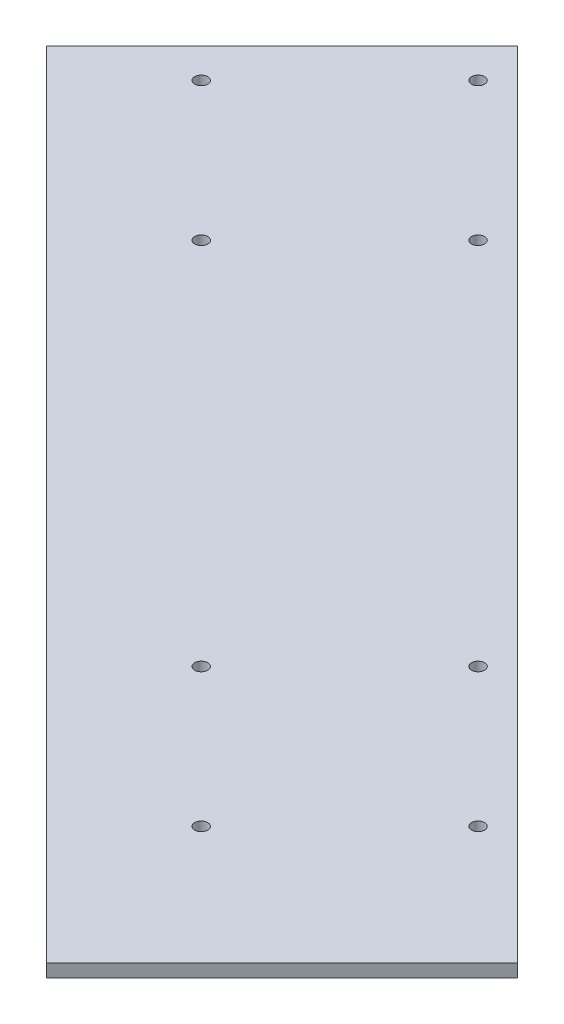
ISO-10303-21;
HEADER;
FILE_DESCRIPTION(('STEP AP214'),'2;1');
FILE_NAME('part.step','',(''),(''),'','','');
FILE_SCHEMA(('AUTOMOTIVE_DESIGN { 1 0 10303 214 1 1 1 1 }'));
ENDSEC;
DATA;
#1=APPLICATION_CONTEXT('core data for automotive mechanical design processes');
#2=APPLICATION_PROTOCOL_DEFINITION('international standard','automotive_design',2000,#1);
#3=PRODUCT_CONTEXT('',#1,'mechanical');
#4=PRODUCT('Part','Part','',(#3));
#5=PRODUCT_RELATED_PRODUCT_CATEGORY('part','',(#4));
#6=PRODUCT_DEFINITION_FORMATION('','',#4);
#7=PRODUCT_DEFINITION_CONTEXT('part definition',#1,'design');
#8=PRODUCT_DEFINITION('design','',#6,#7);
#9=PRODUCT_DEFINITION_SHAPE('','',#8);
#10=(LENGTH_UNIT() NAMED_UNIT(*) SI_UNIT(.MILLI.,.METRE.));
#11=(NAMED_UNIT(*) PLANE_ANGLE_UNIT() SI_UNIT($,.RADIAN.));
#12=(NAMED_UNIT(*) SI_UNIT($,.STERADIAN.) SOLID_ANGLE_UNIT());
#13=UNCERTAINTY_MEASURE_WITH_UNIT(LENGTH_MEASURE(1.E-05),#10,'distance_accuracy_value','');
#14=(GEOMETRIC_REPRESENTATION_CONTEXT(3) GLOBAL_UNCERTAINTY_ASSIGNED_CONTEXT((#13)) GLOBAL_UNIT_ASSIGNED_CONTEXT((#10,
#11,#12)) REPRESENTATION_CONTEXT('',''));
#15=CARTESIAN_POINT('',(0.,0.,0.));
#16=DIRECTION('',(0.,0.,1.));
#17=DIRECTION('',(1.,0.,0.));
#18=AXIS2_PLACEMENT_3D('',#15,#16,#17);
#19=CARTESIAN_POINT('',(0.,10.,0.));
#20=DIRECTION('',(0.,1.,0.));
#21=DIRECTION('',(0.,0.,1.));
#22=AXIS2_PLACEMENT_3D('',#19,#20,#21);
#23=PLANE('',#22);
#24=DIRECTION('',(0.707106781186548,0.,0.707106781186548));
#25=VECTOR('',#24,1.);
#26=CARTESIAN_POINT('',(-469.383041957652,10.,-289.075244035555));
#27=LINE('',#26,#25);
#28=CARTESIAN_POINT('',(-469.383041957652,10.,-289.075244035555));
#29=VERTEX_POINT('',#28);
#30=CARTESIAN_POINT('',(139.075244035559,10.,319.383041957656));
#31=VERTEX_POINT('',#30);
#32=EDGE_CURVE('E79',#29,#31,#27,.T.);
#33=ORIENTED_EDGE('',*,*,#32,.F.);
#34=DIRECTION('',(0.707106781186549,0.,-0.707106781186547));
#35=VECTOR('',#34,1.);
#36=CARTESIAN_POINT('',(-650.,10.,-108.458285993207));
#37=LINE('',#36,#35);
#38=CARTESIAN_POINT('',(-650.,10.,-108.458285993207));
#39=VERTEX_POINT('',#38);
#40=EDGE_CURVE('E105',#39,#29,#37,.T.);
#41=ORIENTED_EDGE('',*,*,#40,.F.);
#42=DIRECTION('',(-0.707106781186551,0.,-0.707106781186544));
#43=VECTOR('',#42,1.);
#44=CARTESIAN_POINT('',(-41.5417140067861,10.,500.));
#45=LINE('',#44,#43);
#46=CARTESIAN_POINT('',(-41.5417140067861,10.,500.));
#47=VERTEX_POINT('',#46);
#48=EDGE_CURVE('E99',#47,#39,#45,.T.);
#49=ORIENTED_EDGE('',*,*,#48,.F.);
#50=DIRECTION('',(-0.707106781186548,0.,0.707106781186547));
#51=VECTOR('',#50,1.);
#52=CARTESIAN_POINT('',(-41.5417140067861,10.,500.));
#53=LINE('',#52,#51);
#54=EDGE_CURVE('E94',#31,#47,#53,.T.);
#55=ORIENTED_EDGE('',*,*,#54,.F.);
#56=EDGE_LOOP('',(#33,#41,#49,#55));
#57=FACE_BOUND('',#56,.T.);
#58=CARTESIAN_POINT('',(33.2340187157668,10.,243.933982822018));
#59=DIRECTION('',(0.,1.,0.));
#60=DIRECTION('',(0.,0.,1.));
#61=AXIS2_PLACEMENT_3D('',#58,#59,#60);
#62=CIRCLE('',#61,5.);
#63=CARTESIAN_POINT('',(33.2340187157668,10.,248.933982822018));
#64=VERTEX_POINT('',#63);
#65=EDGE_CURVE('E130',#64,#64,#62,.T.);
#66=ORIENTED_EDGE('',*,*,#65,.F.);
#67=EDGE_LOOP('',(#66));
#68=FACE_BOUND('',#67,.T.);
#69=CARTESIAN_POINT('',(-72.8319984622154,10.,350.));
#70=DIRECTION('',(0.,1.,0.));
#71=DIRECTION('',(0.,0.,1.));
#72=AXIS2_PLACEMENT_3D('',#69,#70,#71);
#73=CIRCLE('',#72,4.99999999999999);
#74=CARTESIAN_POINT('',(-72.8319984622154,10.,355.));
#75=VERTEX_POINT('',#74);
#76=EDGE_CURVE('E136',#75,#75,#73,.T.);
#77=ORIENTED_EDGE('',*,*,#76,.F.);
#78=EDGE_LOOP('',(#77));
#79=FACE_BOUND('',#78,.T.);
#80=CARTESIAN_POINT('',(-178.898015640198,10.,243.933982822018));
#81=DIRECTION('',(0.,1.,0.));
#82=DIRECTION('',(0.,0.,1.));
#83=AXIS2_PLACEMENT_3D('',#80,#81,#82);
#84=CIRCLE('',#83,5.00000000000011);
#85=CARTESIAN_POINT('',(-178.898015640198,10.,248.933982822018));
#86=VERTEX_POINT('',#85);
#87=EDGE_CURVE('E142',#86,#86,#84,.T.);
#88=ORIENTED_EDGE('',*,*,#87,.F.);
#89=EDGE_LOOP('',(#88));
#90=FACE_BOUND('',#89,.T.);
#91=CARTESIAN_POINT('',(-461.740728114817,10.,-251.040764008565));
#92=DIRECTION('',(0.,1.,0.));
#93=DIRECTION('',(0.,0.,1.));
#94=AXIS2_PLACEMENT_3D('',#91,#92,#93);
#95=CIRCLE('',#94,4.99999999999999);
#96=CARTESIAN_POINT('',(-461.740728114817,10.,-246.040764008565));
#97=VERTEX_POINT('',#96);
#98=EDGE_CURVE('E112',#97,#97,#95,.T.);
#99=ORIENTED_EDGE('',*,*,#98,.F.);
#100=EDGE_LOOP('',(#99));
#101=FACE_BOUND('',#100,.T.);
#102=CARTESIAN_POINT('',(-355.674710936834,10.,-144.974746830583));
#103=DIRECTION('',(0.,1.,0.));
#104=DIRECTION('',(0.,0.,1.));
#105=AXIS2_PLACEMENT_3D('',#102,#103,#104);
#106=CIRCLE('',#105,5.00000000000005);
#107=CARTESIAN_POINT('',(-355.674710936834,10.,-139.974746830583));
#108=VERTEX_POINT('',#107);
#109=EDGE_CURVE('E113',#108,#108,#106,.T.);
#110=ORIENTED_EDGE('',*,*,#109,.F.);
#111=EDGE_LOOP('',(#110));
#112=FACE_BOUND('',#111,.T.);
#113=CARTESIAN_POINT('',(-461.740728114817,10.,-38.908729652601));
#114=DIRECTION('',(0.,1.,0.));
#115=DIRECTION('',(0.,0.,1.));
#116=AXIS2_PLACEMENT_3D('',#113,#114,#115);
#117=CIRCLE('',#116,4.99999999999999);
#118=CARTESIAN_POINT('',(-461.740728114817,10.,-33.9087296526011));
#119=VERTEX_POINT('',#118);
#120=EDGE_CURVE('E119',#119,#119,#117,.T.);
#121=ORIENTED_EDGE('',*,*,#120,.F.);
#122=EDGE_LOOP('',(#121));
#123=FACE_BOUND('',#122,.T.);
#124=CARTESIAN_POINT('',(-567.806745292799,10.,-144.974746830583));
#125=DIRECTION('',(0.,1.,0.));
#126=DIRECTION('',(0.,0.,1.));
#127=AXIS2_PLACEMENT_3D('',#124,#125,#126);
#128=CIRCLE('',#127,5.00000000000005);
#129=CARTESIAN_POINT('',(-567.806745292799,10.,-139.974746830583));
#130=VERTEX_POINT('',#129);
#131=EDGE_CURVE('E108',#130,#130,#128,.T.);
#132=ORIENTED_EDGE('',*,*,#131,.F.);
#133=EDGE_LOOP('',(#132));
#134=FACE_BOUND('',#133,.T.);
#135=CARTESIAN_POINT('',(-72.8319984622155,10.,137.867965644036));
#136=DIRECTION('',(0.,1.,0.));
#137=DIRECTION('',(0.,0.,1.));
#138=AXIS2_PLACEMENT_3D('',#135,#136,#137);
#139=CIRCLE('',#138,5.00000000000001);
#140=CARTESIAN_POINT('',(-72.8319984622155,10.,142.867965644036));
#141=VERTEX_POINT('',#140);
#142=EDGE_CURVE('E41',#141,#141,#139,.T.);
#143=ORIENTED_EDGE('',*,*,#142,.F.);
#144=EDGE_LOOP('',(#143));
#145=FACE_BOUND('',#144,.T.);
#146=ADVANCED_FACE('F37',(#57,#68,#79,#90,#101,#112,#123,#134,#145),#23,.T.);
#147=CARTESIAN_POINT('',(0.,0.,0.));
#148=DIRECTION('',(0.,1.,0.));
#149=DIRECTION('',(0.,0.,1.));
#150=AXIS2_PLACEMENT_3D('',#147,#148,#149);
#151=PLANE('',#150);
#152=CARTESIAN_POINT('',(33.2340187157668,0.,243.933982822018));
#153=DIRECTION('',(0.,1.,0.));
#154=DIRECTION('',(0.,0.,1.));
#155=AXIS2_PLACEMENT_3D('',#152,#153,#154);
#156=CIRCLE('',#155,5.);
#157=CARTESIAN_POINT('',(33.2340187157668,0.,248.933982822018));
#158=VERTEX_POINT('',#157);
#159=EDGE_CURVE('E127',#158,#158,#156,.T.);
#160=ORIENTED_EDGE('',*,*,#159,.T.);
#161=EDGE_LOOP('',(#160));
#162=FACE_BOUND('',#161,.T.);
#163=CARTESIAN_POINT('',(-72.8319984622154,0.,350.));
#164=DIRECTION('',(0.,1.,0.));
#165=DIRECTION('',(0.,0.,1.));
#166=AXIS2_PLACEMENT_3D('',#163,#164,#165);
#167=CIRCLE('',#166,4.99999999999999);
#168=CARTESIAN_POINT('',(-72.8319984622154,0.,355.));
#169=VERTEX_POINT('',#168);
#170=EDGE_CURVE('E133',#169,#169,#167,.T.);
#171=ORIENTED_EDGE('',*,*,#170,.T.);
#172=EDGE_LOOP('',(#171));
#173=FACE_BOUND('',#172,.T.);
#174=CARTESIAN_POINT('',(-178.898015640198,0.,243.933982822018));
#175=DIRECTION('',(0.,1.,0.));
#176=DIRECTION('',(0.,0.,1.));
#177=AXIS2_PLACEMENT_3D('',#174,#175,#176);
#178=CIRCLE('',#177,5.00000000000011);
#179=CARTESIAN_POINT('',(-178.898015640198,0.,248.933982822018));
#180=VERTEX_POINT('',#179);
#181=EDGE_CURVE('E139',#180,#180,#178,.T.);
#182=ORIENTED_EDGE('',*,*,#181,.T.);
#183=EDGE_LOOP('',(#182));
#184=FACE_BOUND('',#183,.T.);
#185=CARTESIAN_POINT('',(-461.740728114817,0.,-251.040764008565));
#186=DIRECTION('',(0.,1.,0.));
#187=DIRECTION('',(0.,0.,1.));
#188=AXIS2_PLACEMENT_3D('',#185,#186,#187);
#189=CIRCLE('',#188,4.99999999999999);
#190=CARTESIAN_POINT('',(-461.740728114817,0.,-246.040764008565));
#191=VERTEX_POINT('',#190);
#192=EDGE_CURVE('E145',#191,#191,#189,.T.);
#193=ORIENTED_EDGE('',*,*,#192,.T.);
#194=EDGE_LOOP('',(#193));
#195=FACE_BOUND('',#194,.T.);
#196=CARTESIAN_POINT('',(-355.674710936834,0.,-144.974746830583));
#197=DIRECTION('',(0.,1.,0.));
#198=DIRECTION('',(0.,0.,1.));
#199=AXIS2_PLACEMENT_3D('',#196,#197,#198);
#200=CIRCLE('',#199,5.00000000000005);
#201=CARTESIAN_POINT('',(-355.674710936834,0.,-139.974746830583));
#202=VERTEX_POINT('',#201);
#203=EDGE_CURVE('E109',#202,#202,#200,.T.);
#204=ORIENTED_EDGE('',*,*,#203,.T.);
#205=EDGE_LOOP('',(#204));
#206=FACE_BOUND('',#205,.T.);
#207=CARTESIAN_POINT('',(-461.740728114817,0.,-38.908729652601));
#208=DIRECTION('',(0.,1.,0.));
#209=DIRECTION('',(0.,0.,1.));
#210=AXIS2_PLACEMENT_3D('',#207,#208,#209);
#211=CIRCLE('',#210,4.99999999999999);
#212=CARTESIAN_POINT('',(-461.740728114817,0.,-33.9087296526011));
#213=VERTEX_POINT('',#212);
#214=EDGE_CURVE('E116',#213,#213,#211,.T.);
#215=ORIENTED_EDGE('',*,*,#214,.T.);
#216=EDGE_LOOP('',(#215));
#217=FACE_BOUND('',#216,.T.);
#218=CARTESIAN_POINT('',(-567.806745292799,0.,-144.974746830583));
#219=DIRECTION('',(0.,1.,0.));
#220=DIRECTION('',(0.,0.,1.));
#221=AXIS2_PLACEMENT_3D('',#218,#219,#220);
#222=CIRCLE('',#221,5.00000000000005);
#223=CARTESIAN_POINT('',(-567.806745292799,0.,-139.974746830583));
#224=VERTEX_POINT('',#223);
#225=EDGE_CURVE('E122',#224,#224,#222,.T.);
#226=ORIENTED_EDGE('',*,*,#225,.T.);
#227=EDGE_LOOP('',(#226));
#228=FACE_BOUND('',#227,.T.);
#229=CARTESIAN_POINT('',(-72.8319984622155,0.,137.867965644036));
#230=DIRECTION('',(0.,1.,0.));
#231=DIRECTION('',(0.,0.,1.));
#232=AXIS2_PLACEMENT_3D('',#229,#230,#231);
#233=CIRCLE('',#232,5.00000000000001);
#234=CARTESIAN_POINT('',(-72.8319984622155,0.,142.867965644036));
#235=VERTEX_POINT('',#234);
#236=EDGE_CURVE('E11',#235,#235,#233,.T.);
#237=ORIENTED_EDGE('',*,*,#236,.T.);
#238=EDGE_LOOP('',(#237));
#239=FACE_BOUND('',#238,.T.);
#240=DIRECTION('',(0.707106781186549,0.,-0.707106781186547));
#241=VECTOR('',#240,1.);
#242=CARTESIAN_POINT('',(-650.,0.,-108.458285993207));
#243=LINE('',#242,#241);
#244=CARTESIAN_POINT('',(-650.,0.,-108.458285993207));
#245=VERTEX_POINT('',#244);
#246=CARTESIAN_POINT('',(-469.383041957652,0.,-289.075244035555));
#247=VERTEX_POINT('',#246);
#248=EDGE_CURVE('E59',#245,#247,#243,.T.);
#249=ORIENTED_EDGE('',*,*,#248,.T.);
#250=DIRECTION('',(0.707106781186548,0.,0.707106781186548));
#251=VECTOR('',#250,1.);
#252=CARTESIAN_POINT('',(-469.383041957652,0.,-289.075244035555));
#253=LINE('',#252,#251);
#254=CARTESIAN_POINT('',(139.075244035559,0.,319.383041957656));
#255=VERTEX_POINT('',#254);
#256=EDGE_CURVE('E52',#247,#255,#253,.T.);
#257=ORIENTED_EDGE('',*,*,#256,.T.);
#258=DIRECTION('',(-0.707106781186548,0.,0.707106781186547));
#259=VECTOR('',#258,1.);
#260=CARTESIAN_POINT('',(-41.5417140067861,0.,500.));
#261=LINE('',#260,#259);
#262=CARTESIAN_POINT('',(-41.5417140067861,0.,500.));
#263=VERTEX_POINT('',#262);
#264=EDGE_CURVE('E83',#255,#263,#261,.T.);
#265=ORIENTED_EDGE('',*,*,#264,.T.);
#266=DIRECTION('',(-0.707106781186551,0.,-0.707106781186544));
#267=VECTOR('',#266,1.);
#268=CARTESIAN_POINT('',(-41.5417140067861,0.,500.));
#269=LINE('',#268,#267);
#270=EDGE_CURVE('E103',#263,#245,#269,.T.);
#271=ORIENTED_EDGE('',*,*,#270,.T.);
#272=EDGE_LOOP('',(#249,#257,#265,#271));
#273=FACE_BOUND('',#272,.T.);
#274=ADVANCED_FACE('F39',(#162,#173,#184,#195,#206,#217,#228,#239,#273),#151,.F.);
#275=CARTESIAN_POINT('',(-72.8319984622155,0.,137.867965644036));
#276=DIRECTION('',(0.,1.,0.));
#277=DIRECTION('',(0.,0.,1.));
#278=AXIS2_PLACEMENT_3D('',#275,#276,#277);
#279=CYLINDRICAL_SURFACE('',#278,5.00000000000001);
#280=ORIENTED_EDGE('',*,*,#236,.F.);
#281=EDGE_LOOP('',(#280));
#282=FACE_BOUND('',#281,.T.);
#283=ORIENTED_EDGE('',*,*,#142,.T.);
#284=EDGE_LOOP('',(#283));
#285=FACE_BOUND('',#284,.T.);
#286=ADVANCED_FACE('F165',(#282,#285),#279,.F.);
#287=CARTESIAN_POINT('',(-567.806745292799,0.,-144.974746830583));
#288=DIRECTION('',(0.,1.,0.));
#289=DIRECTION('',(0.,0.,1.));
#290=AXIS2_PLACEMENT_3D('',#287,#288,#289);
#291=CYLINDRICAL_SURFACE('',#290,5.00000000000005);
#292=ORIENTED_EDGE('',*,*,#225,.F.);
#293=EDGE_LOOP('',(#292));
#294=FACE_BOUND('',#293,.T.);
#295=ORIENTED_EDGE('',*,*,#131,.T.);
#296=EDGE_LOOP('',(#295));
#297=FACE_BOUND('',#296,.T.);
#298=ADVANCED_FACE('F167',(#294,#297),#291,.F.);
#299=CARTESIAN_POINT('',(-461.740728114817,0.,-38.908729652601));
#300=DIRECTION('',(0.,1.,0.));
#301=DIRECTION('',(0.,0.,1.));
#302=AXIS2_PLACEMENT_3D('',#299,#300,#301);
#303=CYLINDRICAL_SURFACE('',#302,4.99999999999999);
#304=ORIENTED_EDGE('',*,*,#214,.F.);
#305=EDGE_LOOP('',(#304));
#306=FACE_BOUND('',#305,.T.);
#307=ORIENTED_EDGE('',*,*,#120,.T.);
#308=EDGE_LOOP('',(#307));
#309=FACE_BOUND('',#308,.T.);
#310=ADVANCED_FACE('F174',(#306,#309),#303,.F.);
#311=CARTESIAN_POINT('',(-355.674710936834,0.,-144.974746830583));
#312=DIRECTION('',(0.,1.,0.));
#313=DIRECTION('',(0.,0.,1.));
#314=AXIS2_PLACEMENT_3D('',#311,#312,#313);
#315=CYLINDRICAL_SURFACE('',#314,5.00000000000005);
#316=ORIENTED_EDGE('',*,*,#203,.F.);
#317=EDGE_LOOP('',(#316));
#318=FACE_BOUND('',#317,.T.);
#319=ORIENTED_EDGE('',*,*,#109,.T.);
#320=EDGE_LOOP('',(#319));
#321=FACE_BOUND('',#320,.T.);
#322=ADVANCED_FACE('F183',(#318,#321),#315,.F.);
#323=CARTESIAN_POINT('',(-461.740728114817,0.,-251.040764008565));
#324=DIRECTION('',(0.,1.,0.));
#325=DIRECTION('',(0.,0.,1.));
#326=AXIS2_PLACEMENT_3D('',#323,#324,#325);
#327=CYLINDRICAL_SURFACE('',#326,4.99999999999999);
#328=ORIENTED_EDGE('',*,*,#192,.F.);
#329=EDGE_LOOP('',(#328));
#330=FACE_BOUND('',#329,.T.);
#331=ORIENTED_EDGE('',*,*,#98,.T.);
#332=EDGE_LOOP('',(#331));
#333=FACE_BOUND('',#332,.T.);
#334=ADVANCED_FACE('F151',(#330,#333),#327,.F.);
#335=CARTESIAN_POINT('',(-178.898015640198,0.,243.933982822018));
#336=DIRECTION('',(0.,1.,0.));
#337=DIRECTION('',(0.,0.,1.));
#338=AXIS2_PLACEMENT_3D('',#335,#336,#337);
#339=CYLINDRICAL_SURFACE('',#338,5.00000000000011);
#340=ORIENTED_EDGE('',*,*,#181,.F.);
#341=EDGE_LOOP('',(#340));
#342=FACE_BOUND('',#341,.T.);
#343=ORIENTED_EDGE('',*,*,#87,.T.);
#344=EDGE_LOOP('',(#343));
#345=FACE_BOUND('',#344,.T.);
#346=ADVANCED_FACE('F182',(#342,#345),#339,.F.);
#347=CARTESIAN_POINT('',(-72.8319984622154,0.,350.));
#348=DIRECTION('',(0.,1.,0.));
#349=DIRECTION('',(0.,0.,1.));
#350=AXIS2_PLACEMENT_3D('',#347,#348,#349);
#351=CYLINDRICAL_SURFACE('',#350,4.99999999999999);
#352=ORIENTED_EDGE('',*,*,#170,.F.);
#353=EDGE_LOOP('',(#352));
#354=FACE_BOUND('',#353,.T.);
#355=ORIENTED_EDGE('',*,*,#76,.T.);
#356=EDGE_LOOP('',(#355));
#357=FACE_BOUND('',#356,.T.);
#358=ADVANCED_FACE('F187',(#354,#357),#351,.F.);
#359=CARTESIAN_POINT('',(33.2340187157668,0.,243.933982822018));
#360=DIRECTION('',(0.,1.,0.));
#361=DIRECTION('',(0.,0.,1.));
#362=AXIS2_PLACEMENT_3D('',#359,#360,#361);
#363=CYLINDRICAL_SURFACE('',#362,5.);
#364=ORIENTED_EDGE('',*,*,#159,.F.);
#365=EDGE_LOOP('',(#364));
#366=FACE_BOUND('',#365,.T.);
#367=ORIENTED_EDGE('',*,*,#65,.T.);
#368=EDGE_LOOP('',(#367));
#369=FACE_BOUND('',#368,.T.);
#370=ADVANCED_FACE('F191',(#366,#369),#363,.F.);
#371=CARTESIAN_POINT('',(-41.5417140067861,10.,500.));
#372=DIRECTION('',(-0.707106781186544,0.,0.707106781186551));
#373=DIRECTION('',(0.707106781186551,0.,0.707106781186544));
#374=AXIS2_PLACEMENT_3D('',#371,#372,#373);
#375=PLANE('',#374);
#376=ORIENTED_EDGE('',*,*,#270,.F.);
#377=DIRECTION('',(0.,-1.,0.));
#378=VECTOR('',#377,1.);
#379=CARTESIAN_POINT('',(-41.5417140067861,10.,500.));
#380=LINE('',#379,#378);
#381=EDGE_CURVE('E92',#47,#263,#380,.T.);
#382=ORIENTED_EDGE('',*,*,#381,.F.);
#383=ORIENTED_EDGE('',*,*,#48,.T.);
#384=DIRECTION('',(0.,-1.,0.));
#385=VECTOR('',#384,1.);
#386=CARTESIAN_POINT('',(-650.,10.,-108.458285993207));
#387=LINE('',#386,#385);
#388=EDGE_CURVE('E102',#39,#245,#387,.T.);
#389=ORIENTED_EDGE('',*,*,#388,.T.);
#390=EDGE_LOOP('',(#376,#382,#383,#389));
#391=FACE_BOUND('',#390,.T.);
#392=ADVANCED_FACE('F194',(#391),#375,.T.);
#393=CARTESIAN_POINT('',(-41.5417140067861,10.,500.));
#394=DIRECTION('',(0.707106781186547,0.,0.707106781186548));
#395=DIRECTION('',(0.707106781186548,0.,-0.707106781186547));
#396=AXIS2_PLACEMENT_3D('',#393,#394,#395);
#397=PLANE('',#396);
#398=DIRECTION('',(0.,1.,0.));
#399=VECTOR('',#398,1.);
#400=CARTESIAN_POINT('',(139.075244035559,0.,319.383041957656));
#401=LINE('',#400,#399);
#402=EDGE_CURVE('E76',#255,#31,#401,.T.);
#403=ORIENTED_EDGE('',*,*,#402,.T.);
#404=ORIENTED_EDGE('',*,*,#54,.T.);
#405=ORIENTED_EDGE('',*,*,#381,.T.);
#406=ORIENTED_EDGE('',*,*,#264,.F.);
#407=EDGE_LOOP('',(#403,#404,#405,#406));
#408=FACE_BOUND('',#407,.T.);
#409=ADVANCED_FACE('F90',(#408),#397,.T.);
#410=CARTESIAN_POINT('',(-650.,10.,-108.458285993207));
#411=DIRECTION('',(-0.707106781186547,0.,-0.707106781186549));
#412=DIRECTION('',(-0.707106781186549,0.,0.707106781186547));
#413=AXIS2_PLACEMENT_3D('',#410,#411,#412);
#414=PLANE('',#413);
#415=DIRECTION('',(0.,1.,0.));
#416=VECTOR('',#415,1.);
#417=CARTESIAN_POINT('',(-469.383041957652,0.,-289.075244035555));
#418=LINE('',#417,#416);
#419=EDGE_CURVE('E84',#247,#29,#418,.T.);
#420=ORIENTED_EDGE('',*,*,#419,.F.);
#421=ORIENTED_EDGE('',*,*,#248,.F.);
#422=ORIENTED_EDGE('',*,*,#388,.F.);
#423=ORIENTED_EDGE('',*,*,#40,.T.);
#424=EDGE_LOOP('',(#420,#421,#422,#423));
#425=FACE_BOUND('',#424,.T.);
#426=ADVANCED_FACE('F208',(#425),#414,.T.);
#427=CARTESIAN_POINT('',(-469.383041957652,0.,-289.075244035555));
#428=DIRECTION('',(-0.707106781186548,0.,0.707106781186548));
#429=DIRECTION('',(0.707106781186548,0.,0.707106781186548));
#430=AXIS2_PLACEMENT_3D('',#427,#428,#429);
#431=PLANE('',#430);
#432=ORIENTED_EDGE('',*,*,#32,.T.);
#433=ORIENTED_EDGE('',*,*,#402,.F.);
#434=ORIENTED_EDGE('',*,*,#256,.F.);
#435=ORIENTED_EDGE('',*,*,#419,.T.);
#436=EDGE_LOOP('',(#432,#433,#434,#435));
#437=FACE_BOUND('',#436,.T.);
#438=ADVANCED_FACE('F77',(#437),#431,.F.);
#439=CLOSED_SHELL('',(#146,#274,#286,#298,#310,#322,#334,#346,#358,#370,#392,#409,#426,#438));
#440=MANIFOLD_SOLID_BREP('B2',#439);
#441=ADVANCED_BREP_SHAPE_REPRESENTATION('',(#18,#440),#14);
#442=SHAPE_DEFINITION_REPRESENTATION(#9,#441);
ENDSEC;
END-ISO-10303-21;
